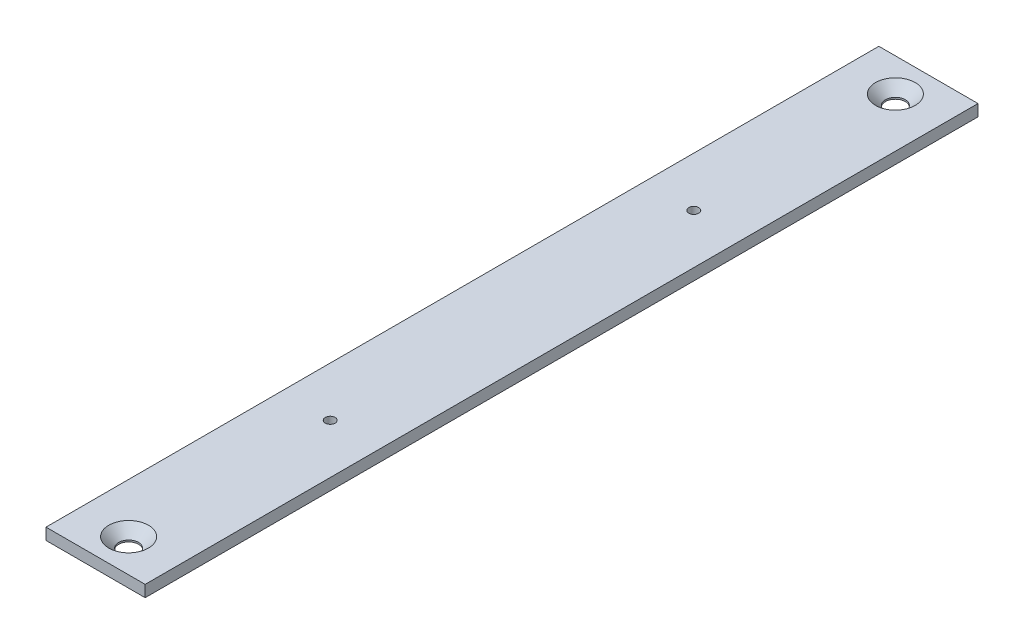
ISO-10303-21;
HEADER;
FILE_DESCRIPTION(('STEP AP214'),'2;1');
FILE_NAME('part.step','',(''),(''),'','','');
FILE_SCHEMA(('AUTOMOTIVE_DESIGN { 1 0 10303 214 1 1 1 1 }'));
ENDSEC;
DATA;
#1=APPLICATION_CONTEXT('core data for automotive mechanical design processes');
#2=APPLICATION_PROTOCOL_DEFINITION('international standard','automotive_design',2000,#1);
#3=PRODUCT_CONTEXT('',#1,'mechanical');
#4=PRODUCT('Part','Part','',(#3));
#5=PRODUCT_RELATED_PRODUCT_CATEGORY('part','',(#4));
#6=PRODUCT_DEFINITION_FORMATION('','',#4);
#7=PRODUCT_DEFINITION_CONTEXT('part definition',#1,'design');
#8=PRODUCT_DEFINITION('design','',#6,#7);
#9=PRODUCT_DEFINITION_SHAPE('','',#8);
#10=(LENGTH_UNIT() NAMED_UNIT(*) SI_UNIT(.MILLI.,.METRE.));
#11=(NAMED_UNIT(*) PLANE_ANGLE_UNIT() SI_UNIT($,.RADIAN.));
#12=(NAMED_UNIT(*) SI_UNIT($,.STERADIAN.) SOLID_ANGLE_UNIT());
#13=UNCERTAINTY_MEASURE_WITH_UNIT(LENGTH_MEASURE(1.E-05),#10,'distance_accuracy_value','');
#14=(GEOMETRIC_REPRESENTATION_CONTEXT(3) GLOBAL_UNCERTAINTY_ASSIGNED_CONTEXT((#13)) GLOBAL_UNIT_ASSIGNED_CONTEXT((#10,
#11,#12)) REPRESENTATION_CONTEXT('',''));
#15=CARTESIAN_POINT('',(0.,0.,0.));
#16=DIRECTION('',(0.,0.,1.));
#17=DIRECTION('',(1.,0.,0.));
#18=AXIS2_PLACEMENT_3D('',#15,#16,#17);
#19=CARTESIAN_POINT('',(15.,3.5,126.));
#20=DIRECTION('',(-1.,0.,0.));
#21=DIRECTION('',(0.,0.,1.));
#22=AXIS2_PLACEMENT_3D('',#19,#20,#21);
#23=PLANE('',#22);
#24=DIRECTION('',(0.,0.,-1.));
#25=VECTOR('',#24,1.);
#26=CARTESIAN_POINT('',(15.,0.,126.));
#27=LINE('',#26,#25);
#28=CARTESIAN_POINT('',(15.,0.,126.));
#29=VERTEX_POINT('',#28);
#30=CARTESIAN_POINT('',(15.,0.,-126.));
#31=VERTEX_POINT('',#30);
#32=EDGE_CURVE('E119',#29,#31,#27,.T.);
#33=ORIENTED_EDGE('',*,*,#32,.T.);
#34=DIRECTION('',(0.,-1.,0.));
#35=VECTOR('',#34,1.);
#36=CARTESIAN_POINT('',(15.,3.5,-126.));
#37=LINE('',#36,#35);
#38=CARTESIAN_POINT('',(15.,3.5,-126.));
#39=VERTEX_POINT('',#38);
#40=EDGE_CURVE('E108',#39,#31,#37,.T.);
#41=ORIENTED_EDGE('',*,*,#40,.F.);
#42=DIRECTION('',(0.,0.,-1.));
#43=VECTOR('',#42,1.);
#44=CARTESIAN_POINT('',(15.,3.5,126.));
#45=LINE('',#44,#43);
#46=CARTESIAN_POINT('',(15.,3.5,126.));
#47=VERTEX_POINT('',#46);
#48=EDGE_CURVE('E100',#47,#39,#45,.T.);
#49=ORIENTED_EDGE('',*,*,#48,.F.);
#50=DIRECTION('',(0.,-1.,0.));
#51=VECTOR('',#50,1.);
#52=CARTESIAN_POINT('',(15.,3.5,126.));
#53=LINE('',#52,#51);
#54=EDGE_CURVE('E115',#47,#29,#53,.T.);
#55=ORIENTED_EDGE('',*,*,#54,.T.);
#56=EDGE_LOOP('',(#33,#41,#49,#55));
#57=FACE_BOUND('',#56,.T.);
#58=ADVANCED_FACE('F45',(#57),#23,.F.);
#59=CARTESIAN_POINT('',(-15.,3.5,-126.));
#60=DIRECTION('',(0.,0.,1.));
#61=DIRECTION('',(1.,0.,0.));
#62=AXIS2_PLACEMENT_3D('',#59,#60,#61);
#63=PLANE('',#62);
#64=DIRECTION('',(-1.,0.,0.));
#65=VECTOR('',#64,1.);
#66=CARTESIAN_POINT('',(-15.,0.,-126.));
#67=LINE('',#66,#65);
#68=CARTESIAN_POINT('',(-15.,0.,-126.));
#69=VERTEX_POINT('',#68);
#70=EDGE_CURVE('E106',#31,#69,#67,.T.);
#71=ORIENTED_EDGE('',*,*,#70,.T.);
#72=DIRECTION('',(0.,-1.,0.));
#73=VECTOR('',#72,1.);
#74=CARTESIAN_POINT('',(-15.,3.5,-126.));
#75=LINE('',#74,#73);
#76=CARTESIAN_POINT('',(-15.,3.5,-126.));
#77=VERTEX_POINT('',#76);
#78=EDGE_CURVE('E104',#77,#69,#75,.T.);
#79=ORIENTED_EDGE('',*,*,#78,.F.);
#80=DIRECTION('',(-1.,0.,0.));
#81=VECTOR('',#80,1.);
#82=CARTESIAN_POINT('',(-15.,3.5,-126.));
#83=LINE('',#82,#81);
#84=EDGE_CURVE('E95',#39,#77,#83,.T.);
#85=ORIENTED_EDGE('',*,*,#84,.F.);
#86=ORIENTED_EDGE('',*,*,#40,.T.);
#87=EDGE_LOOP('',(#71,#79,#85,#86));
#88=FACE_BOUND('',#87,.T.);
#89=ADVANCED_FACE('F105',(#88),#63,.F.);
#90=CARTESIAN_POINT('',(-15.,3.5,126.));
#91=DIRECTION('',(1.,0.,0.));
#92=DIRECTION('',(0.,0.,-1.));
#93=AXIS2_PLACEMENT_3D('',#90,#91,#92);
#94=PLANE('',#93);
#95=DIRECTION('',(0.,0.,1.));
#96=VECTOR('',#95,1.);
#97=CARTESIAN_POINT('',(-15.,0.,126.));
#98=LINE('',#97,#96);
#99=CARTESIAN_POINT('',(-15.,0.,126.));
#100=VERTEX_POINT('',#99);
#101=EDGE_CURVE('E81',#69,#100,#98,.T.);
#102=ORIENTED_EDGE('',*,*,#101,.T.);
#103=DIRECTION('',(0.,-1.,0.));
#104=VECTOR('',#103,1.);
#105=CARTESIAN_POINT('',(-15.,3.5,126.));
#106=LINE('',#105,#104);
#107=CARTESIAN_POINT('',(-15.,3.5,126.));
#108=VERTEX_POINT('',#107);
#109=EDGE_CURVE('E109',#108,#100,#106,.T.);
#110=ORIENTED_EDGE('',*,*,#109,.F.);
#111=DIRECTION('',(0.,0.,1.));
#112=VECTOR('',#111,1.);
#113=CARTESIAN_POINT('',(-15.,3.5,126.));
#114=LINE('',#113,#112);
#115=EDGE_CURVE('E98',#77,#108,#114,.T.);
#116=ORIENTED_EDGE('',*,*,#115,.F.);
#117=ORIENTED_EDGE('',*,*,#78,.T.);
#118=EDGE_LOOP('',(#102,#110,#116,#117));
#119=FACE_BOUND('',#118,.T.);
#120=ADVANCED_FACE('F111',(#119),#94,.F.);
#121=CARTESIAN_POINT('',(-15.,3.5,126.));
#122=DIRECTION('',(0.,0.,-1.));
#123=DIRECTION('',(-1.,0.,0.));
#124=AXIS2_PLACEMENT_3D('',#121,#122,#123);
#125=PLANE('',#124);
#126=DIRECTION('',(1.,0.,0.));
#127=VECTOR('',#126,1.);
#128=CARTESIAN_POINT('',(-15.,0.,126.));
#129=LINE('',#128,#127);
#130=EDGE_CURVE('E87',#100,#29,#129,.T.);
#131=ORIENTED_EDGE('',*,*,#130,.T.);
#132=ORIENTED_EDGE('',*,*,#54,.F.);
#133=DIRECTION('',(1.,0.,0.));
#134=VECTOR('',#133,1.);
#135=CARTESIAN_POINT('',(-15.,3.5,126.));
#136=LINE('',#135,#134);
#137=EDGE_CURVE('E64',#108,#47,#136,.T.);
#138=ORIENTED_EDGE('',*,*,#137,.F.);
#139=ORIENTED_EDGE('',*,*,#109,.T.);
#140=EDGE_LOOP('',(#131,#132,#138,#139));
#141=FACE_BOUND('',#140,.T.);
#142=ADVANCED_FACE('F199',(#141),#125,.F.);
#143=CARTESIAN_POINT('',(0.,3.5,0.));
#144=DIRECTION('',(0.,-1.,0.));
#145=DIRECTION('',(0.,0.,-1.));
#146=AXIS2_PLACEMENT_3D('',#143,#144,#145);
#147=PLANE('',#146);
#148=CARTESIAN_POINT('',(0.,3.5,116.));
#149=DIRECTION('',(0.,-1.,0.));
#150=DIRECTION('',(0.,0.,-1.));
#151=AXIS2_PLACEMENT_3D('',#148,#149,#150);
#152=CIRCLE('',#151,6.00000000000006);
#153=CARTESIAN_POINT('',(0.,3.5,110.));
#154=VERTEX_POINT('',#153);
#155=EDGE_CURVE('E56',#154,#154,#152,.T.);
#156=ORIENTED_EDGE('',*,*,#155,.T.);
#157=EDGE_LOOP('',(#156));
#158=FACE_BOUND('',#157,.T.);
#159=CARTESIAN_POINT('',(0.,3.5,-116.));
#160=DIRECTION('',(0.,-1.,0.));
#161=DIRECTION('',(0.,0.,-1.));
#162=AXIS2_PLACEMENT_3D('',#159,#160,#161);
#163=CIRCLE('',#162,6.00000000000006);
#164=CARTESIAN_POINT('',(0.,3.5,-122.));
#165=VERTEX_POINT('',#164);
#166=EDGE_CURVE('E140',#165,#165,#163,.T.);
#167=ORIENTED_EDGE('',*,*,#166,.T.);
#168=EDGE_LOOP('',(#167));
#169=FACE_BOUND('',#168,.T.);
#170=CARTESIAN_POINT('',(0.,3.5,55.));
#171=DIRECTION('',(0.,1.,0.));
#172=DIRECTION('',(0.,0.,-1.));
#173=AXIS2_PLACEMENT_3D('',#170,#171,#172);
#174=CIRCLE('',#173,1.5);
#175=CARTESIAN_POINT('',(0.,3.5,53.5));
#176=VERTEX_POINT('',#175);
#177=EDGE_CURVE('E178',#176,#176,#174,.T.);
#178=ORIENTED_EDGE('',*,*,#177,.F.);
#179=EDGE_LOOP('',(#178));
#180=FACE_BOUND('',#179,.T.);
#181=CARTESIAN_POINT('',(0.,3.5,-55.));
#182=DIRECTION('',(0.,1.,0.));
#183=DIRECTION('',(0.,0.,1.));
#184=AXIS2_PLACEMENT_3D('',#181,#182,#183);
#185=CIRCLE('',#184,1.5);
#186=CARTESIAN_POINT('',(0.,3.5,-53.5));
#187=VERTEX_POINT('',#186);
#188=EDGE_CURVE('E175',#187,#187,#185,.T.);
#189=ORIENTED_EDGE('',*,*,#188,.F.);
#190=EDGE_LOOP('',(#189));
#191=FACE_BOUND('',#190,.T.);
#192=ORIENTED_EDGE('',*,*,#48,.T.);
#193=ORIENTED_EDGE('',*,*,#84,.T.);
#194=ORIENTED_EDGE('',*,*,#115,.T.);
#195=ORIENTED_EDGE('',*,*,#137,.T.);
#196=EDGE_LOOP('',(#192,#193,#194,#195));
#197=FACE_BOUND('',#196,.T.);
#198=ADVANCED_FACE('F96',(#158,#169,#180,#191,#197),#147,.F.);
#199=CARTESIAN_POINT('',(0.,0.,0.));
#200=DIRECTION('',(0.,-1.,0.));
#201=DIRECTION('',(0.,0.,-1.));
#202=AXIS2_PLACEMENT_3D('',#199,#200,#201);
#203=PLANE('',#202);
#204=CARTESIAN_POINT('',(0.,0.,116.));
#205=DIRECTION('',(0.,1.,0.));
#206=DIRECTION('',(0.,0.,-1.));
#207=AXIS2_PLACEMENT_3D('',#204,#205,#206);
#208=CIRCLE('',#207,3.);
#209=CARTESIAN_POINT('',(0.,0.,113.));
#210=VERTEX_POINT('',#209);
#211=EDGE_CURVE('E161',#210,#210,#208,.T.);
#212=ORIENTED_EDGE('',*,*,#211,.T.);
#213=EDGE_LOOP('',(#212));
#214=FACE_BOUND('',#213,.T.);
#215=CARTESIAN_POINT('',(0.,0.,-116.));
#216=DIRECTION('',(0.,1.,0.));
#217=DIRECTION('',(0.,0.,1.));
#218=AXIS2_PLACEMENT_3D('',#215,#216,#217);
#219=CIRCLE('',#218,3.);
#220=CARTESIAN_POINT('',(0.,0.,-113.));
#221=VERTEX_POINT('',#220);
#222=EDGE_CURVE('E164',#221,#221,#219,.T.);
#223=ORIENTED_EDGE('',*,*,#222,.T.);
#224=EDGE_LOOP('',(#223));
#225=FACE_BOUND('',#224,.T.);
#226=CARTESIAN_POINT('',(0.,0.,55.));
#227=DIRECTION('',(0.,1.,0.));
#228=DIRECTION('',(0.,0.,-1.));
#229=AXIS2_PLACEMENT_3D('',#226,#227,#228);
#230=CIRCLE('',#229,1.5);
#231=CARTESIAN_POINT('',(0.,0.,53.5));
#232=VERTEX_POINT('',#231);
#233=EDGE_CURVE('E168',#232,#232,#230,.T.);
#234=ORIENTED_EDGE('',*,*,#233,.T.);
#235=EDGE_LOOP('',(#234));
#236=FACE_BOUND('',#235,.T.);
#237=CARTESIAN_POINT('',(0.,0.,-55.));
#238=DIRECTION('',(0.,1.,0.));
#239=DIRECTION('',(0.,0.,1.));
#240=AXIS2_PLACEMENT_3D('',#237,#238,#239);
#241=CIRCLE('',#240,1.5);
#242=CARTESIAN_POINT('',(0.,0.,-53.5));
#243=VERTEX_POINT('',#242);
#244=EDGE_CURVE('E123',#243,#243,#241,.T.);
#245=ORIENTED_EDGE('',*,*,#244,.T.);
#246=EDGE_LOOP('',(#245));
#247=FACE_BOUND('',#246,.T.);
#248=ORIENTED_EDGE('',*,*,#32,.F.);
#249=ORIENTED_EDGE('',*,*,#130,.F.);
#250=ORIENTED_EDGE('',*,*,#101,.F.);
#251=ORIENTED_EDGE('',*,*,#70,.F.);
#252=EDGE_LOOP('',(#248,#249,#250,#251));
#253=FACE_BOUND('',#252,.T.);
#254=ADVANCED_FACE('F187',(#214,#225,#236,#247,#253),#203,.T.);
#255=CARTESIAN_POINT('',(0.,0.,-55.));
#256=DIRECTION('',(0.,1.,0.));
#257=DIRECTION('',(0.,0.,1.));
#258=AXIS2_PLACEMENT_3D('',#255,#256,#257);
#259=CYLINDRICAL_SURFACE('',#258,1.5);
#260=ORIENTED_EDGE('',*,*,#244,.F.);
#261=EDGE_LOOP('',(#260));
#262=FACE_BOUND('',#261,.T.);
#263=ORIENTED_EDGE('',*,*,#188,.T.);
#264=EDGE_LOOP('',(#263));
#265=FACE_BOUND('',#264,.T.);
#266=ADVANCED_FACE('F193',(#262,#265),#259,.F.);
#267=CARTESIAN_POINT('',(0.,0.,55.));
#268=DIRECTION('',(0.,1.,0.));
#269=DIRECTION('',(0.,0.,1.));
#270=AXIS2_PLACEMENT_3D('',#267,#268,#269);
#271=CYLINDRICAL_SURFACE('',#270,1.5);
#272=ORIENTED_EDGE('',*,*,#233,.F.);
#273=EDGE_LOOP('',(#272));
#274=FACE_BOUND('',#273,.T.);
#275=ORIENTED_EDGE('',*,*,#177,.T.);
#276=EDGE_LOOP('',(#275));
#277=FACE_BOUND('',#276,.T.);
#278=ADVANCED_FACE('F190',(#274,#277),#271,.F.);
#279=CARTESIAN_POINT('',(0.,0.,-116.));
#280=DIRECTION('',(0.,1.,0.));
#281=DIRECTION('',(0.,0.,1.));
#282=AXIS2_PLACEMENT_3D('',#279,#280,#281);
#283=CYLINDRICAL_SURFACE('',#282,3.);
#284=CARTESIAN_POINT('',(0.,0.49999999999993,-116.));
#285=DIRECTION('',(0.,-1.,0.));
#286=DIRECTION('',(0.,0.,-1.));
#287=AXIS2_PLACEMENT_3D('',#284,#285,#286);
#288=CIRCLE('',#287,3.);
#289=CARTESIAN_POINT('',(0.,0.49999999999993,-119.));
#290=VERTEX_POINT('',#289);
#291=EDGE_CURVE('E11',#290,#290,#288,.F.);
#292=ORIENTED_EDGE('',*,*,#291,.T.);
#293=EDGE_LOOP('',(#292));
#294=FACE_BOUND('',#293,.T.);
#295=ORIENTED_EDGE('',*,*,#222,.F.);
#296=EDGE_LOOP('',(#295));
#297=FACE_BOUND('',#296,.T.);
#298=ADVANCED_FACE('F157',(#294,#297),#283,.F.);
#299=CARTESIAN_POINT('',(0.,0.,116.));
#300=DIRECTION('',(0.,1.,0.));
#301=DIRECTION('',(0.,0.,1.));
#302=AXIS2_PLACEMENT_3D('',#299,#300,#301);
#303=CYLINDRICAL_SURFACE('',#302,3.);
#304=CARTESIAN_POINT('',(0.,0.49999999999993,116.));
#305=DIRECTION('',(0.,-1.,0.));
#306=DIRECTION('',(0.,0.,-1.));
#307=AXIS2_PLACEMENT_3D('',#304,#305,#306);
#308=CIRCLE('',#307,3.);
#309=CARTESIAN_POINT('',(0.,0.49999999999993,113.));
#310=VERTEX_POINT('',#309);
#311=EDGE_CURVE('E136',#310,#310,#308,.F.);
#312=ORIENTED_EDGE('',*,*,#311,.T.);
#313=EDGE_LOOP('',(#312));
#314=FACE_BOUND('',#313,.T.);
#315=ORIENTED_EDGE('',*,*,#211,.F.);
#316=EDGE_LOOP('',(#315));
#317=FACE_BOUND('',#316,.T.);
#318=ADVANCED_FACE('F152',(#314,#317),#303,.F.);
#319=CARTESIAN_POINT('',(0.,0.49999999999993,116.));
#320=DIRECTION('',(0.,1.,0.));
#321=DIRECTION('',(0.,0.,1.));
#322=AXIS2_PLACEMENT_3D('',#319,#320,#321);
#323=CONICAL_SURFACE('',#322,3.,0.785398163397447);
#324=ORIENTED_EDGE('',*,*,#155,.F.);
#325=EDGE_LOOP('',(#324));
#326=FACE_BOUND('',#325,.T.);
#327=ORIENTED_EDGE('',*,*,#311,.F.);
#328=EDGE_LOOP('',(#327));
#329=FACE_BOUND('',#328,.T.);
#330=ADVANCED_FACE('F149',(#326,#329),#323,.F.);
#331=CARTESIAN_POINT('',(0.,0.49999999999993,-116.));
#332=DIRECTION('',(0.,1.,0.));
#333=DIRECTION('',(0.,0.,1.));
#334=AXIS2_PLACEMENT_3D('',#331,#332,#333);
#335=CONICAL_SURFACE('',#334,3.,0.785398163397447);
#336=ORIENTED_EDGE('',*,*,#166,.F.);
#337=EDGE_LOOP('',(#336));
#338=FACE_BOUND('',#337,.T.);
#339=ORIENTED_EDGE('',*,*,#291,.F.);
#340=EDGE_LOOP('',(#339));
#341=FACE_BOUND('',#340,.T.);
#342=ADVANCED_FACE('F48',(#338,#341),#335,.F.);
#343=CLOSED_SHELL('',(#58,#89,#120,#142,#198,#254,#266,#278,#298,#318,#330,#342));
#344=MANIFOLD_SOLID_BREP('B2',#343);
#345=ADVANCED_BREP_SHAPE_REPRESENTATION('',(#18,#344),#14);
#346=SHAPE_DEFINITION_REPRESENTATION(#9,#345);
ENDSEC;
END-ISO-10303-21;
